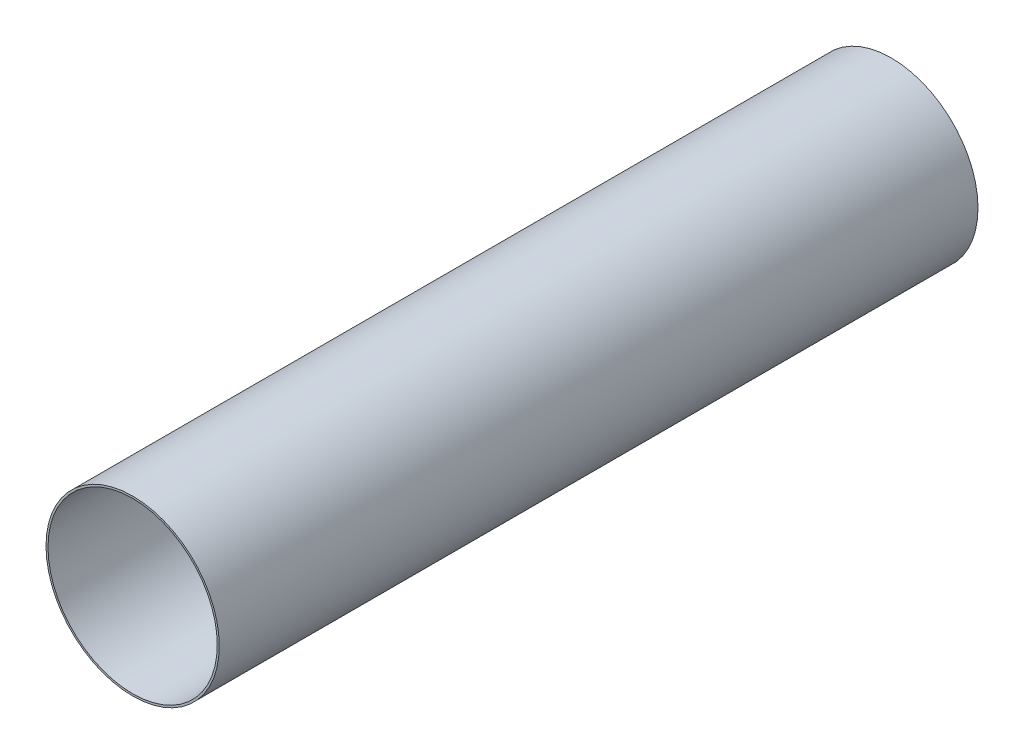
ISO-10303-21;
HEADER;
FILE_DESCRIPTION(('STEP AP214'),'2;1');
FILE_NAME('part.step','',(''),(''),'','','');
FILE_SCHEMA(('AUTOMOTIVE_DESIGN { 1 0 10303 214 1 1 1 1 }'));
ENDSEC;
DATA;
#1=APPLICATION_CONTEXT('core data for automotive mechanical design processes');
#2=APPLICATION_PROTOCOL_DEFINITION('international standard','automotive_design',2000,#1);
#3=PRODUCT_CONTEXT('',#1,'mechanical');
#4=PRODUCT('Part','Part','',(#3));
#5=PRODUCT_RELATED_PRODUCT_CATEGORY('part','',(#4));
#6=PRODUCT_DEFINITION_FORMATION('','',#4);
#7=PRODUCT_DEFINITION_CONTEXT('part definition',#1,'design');
#8=PRODUCT_DEFINITION('design','',#6,#7);
#9=PRODUCT_DEFINITION_SHAPE('','',#8);
#10=(LENGTH_UNIT() NAMED_UNIT(*) SI_UNIT(.MILLI.,.METRE.));
#11=(NAMED_UNIT(*) PLANE_ANGLE_UNIT() SI_UNIT($,.RADIAN.));
#12=(NAMED_UNIT(*) SI_UNIT($,.STERADIAN.) SOLID_ANGLE_UNIT());
#13=UNCERTAINTY_MEASURE_WITH_UNIT(LENGTH_MEASURE(1.E-05),#10,'distance_accuracy_value','');
#14=(GEOMETRIC_REPRESENTATION_CONTEXT(3) GLOBAL_UNCERTAINTY_ASSIGNED_CONTEXT((#13)) GLOBAL_UNIT_ASSIGNED_CONTEXT((#10,
#11,#12)) REPRESENTATION_CONTEXT('',''));
#15=CARTESIAN_POINT('',(0.,0.,0.));
#16=DIRECTION('',(0.,0.,1.));
#17=DIRECTION('',(1.,0.,0.));
#18=AXIS2_PLACEMENT_3D('',#15,#16,#17);
#19=CARTESIAN_POINT('',(0.,0.,381.));
#20=DIRECTION('',(0.,0.,1.));
#21=DIRECTION('',(1.,0.,0.));
#22=AXIS2_PLACEMENT_3D('',#19,#20,#21);
#23=PLANE('',#22);
#24=CARTESIAN_POINT('',(0.,0.,381.));
#25=DIRECTION('',(0.,0.,1.));
#26=DIRECTION('',(1.,0.,0.));
#27=AXIS2_PLACEMENT_3D('',#24,#25,#26);
#28=CIRCLE('',#27,86.99983);
#29=CARTESIAN_POINT('',(86.99983,0.,381.));
#30=VERTEX_POINT('',#29);
#31=EDGE_CURVE('E10',#30,#30,#28,.T.);
#32=ORIENTED_EDGE('',*,*,#31,.T.);
#33=EDGE_LOOP('',(#32));
#34=FACE_BOUND('',#33,.T.);
#35=CARTESIAN_POINT('',(0.,0.,381.));
#36=DIRECTION('',(0.,0.,1.));
#37=DIRECTION('',(1.,0.,0.));
#38=AXIS2_PLACEMENT_3D('',#35,#36,#37);
#39=CIRCLE('',#38,84.99983);
#40=CARTESIAN_POINT('',(84.99983,0.,381.));
#41=VERTEX_POINT('',#40);
#42=EDGE_CURVE('E41',#41,#41,#39,.T.);
#43=ORIENTED_EDGE('',*,*,#42,.F.);
#44=EDGE_LOOP('',(#43));
#45=FACE_BOUND('',#44,.T.);
#46=ADVANCED_FACE('F30',(#34,#45),#23,.T.);
#47=CARTESIAN_POINT('',(0.,0.,-381.));
#48=DIRECTION('',(0.,0.,1.));
#49=DIRECTION('',(1.,0.,0.));
#50=AXIS2_PLACEMENT_3D('',#47,#48,#49);
#51=PLANE('',#50);
#52=CARTESIAN_POINT('',(0.,0.,-381.));
#53=DIRECTION('',(0.,0.,1.));
#54=DIRECTION('',(1.,0.,0.));
#55=AXIS2_PLACEMENT_3D('',#52,#53,#54);
#56=CIRCLE('',#55,86.99983);
#57=CARTESIAN_POINT('',(86.99983,0.,-381.));
#58=VERTEX_POINT('',#57);
#59=EDGE_CURVE('E34',#58,#58,#56,.T.);
#60=ORIENTED_EDGE('',*,*,#59,.F.);
#61=EDGE_LOOP('',(#60));
#62=FACE_BOUND('',#61,.T.);
#63=CARTESIAN_POINT('',(0.,0.,-381.));
#64=DIRECTION('',(0.,0.,1.));
#65=DIRECTION('',(1.,0.,0.));
#66=AXIS2_PLACEMENT_3D('',#63,#64,#65);
#67=CIRCLE('',#66,84.99983);
#68=CARTESIAN_POINT('',(84.99983,0.,-381.));
#69=VERTEX_POINT('',#68);
#70=EDGE_CURVE('E43',#69,#69,#67,.T.);
#71=ORIENTED_EDGE('',*,*,#70,.T.);
#72=EDGE_LOOP('',(#71));
#73=FACE_BOUND('',#72,.T.);
#74=ADVANCED_FACE('F53',(#62,#73),#51,.F.);
#75=CARTESIAN_POINT('',(0.,0.,381.));
#76=DIRECTION('',(0.,0.,-1.));
#77=DIRECTION('',(-1.,0.,0.));
#78=AXIS2_PLACEMENT_3D('',#75,#76,#77);
#79=CYLINDRICAL_SURFACE('',#78,86.99983);
#80=ORIENTED_EDGE('',*,*,#31,.F.);
#81=EDGE_LOOP('',(#80));
#82=FACE_BOUND('',#81,.T.);
#83=ORIENTED_EDGE('',*,*,#59,.T.);
#84=EDGE_LOOP('',(#83));
#85=FACE_BOUND('',#84,.T.);
#86=ADVANCED_FACE('F32',(#82,#85),#79,.T.);
#87=CARTESIAN_POINT('',(0.,0.,381.));
#88=DIRECTION('',(0.,0.,-1.));
#89=DIRECTION('',(-1.,0.,0.));
#90=AXIS2_PLACEMENT_3D('',#87,#88,#89);
#91=CYLINDRICAL_SURFACE('',#90,84.99983);
#92=ORIENTED_EDGE('',*,*,#42,.T.);
#93=EDGE_LOOP('',(#92));
#94=FACE_BOUND('',#93,.T.);
#95=ORIENTED_EDGE('',*,*,#70,.F.);
#96=EDGE_LOOP('',(#95));
#97=FACE_BOUND('',#96,.T.);
#98=ADVANCED_FACE('F49',(#94,#97),#91,.F.);
#99=CLOSED_SHELL('',(#46,#74,#86,#98));
#100=MANIFOLD_SOLID_BREP('B2',#99);
#101=ADVANCED_BREP_SHAPE_REPRESENTATION('',(#18,#100),#14);
#102=SHAPE_DEFINITION_REPRESENTATION(#9,#101);
ENDSEC;
END-ISO-10303-21;
